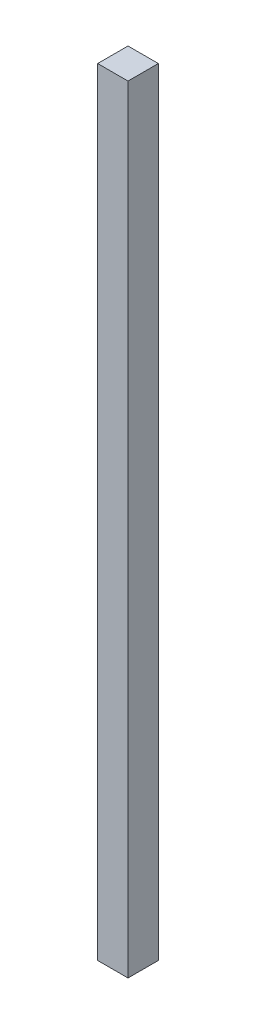
ISO-10303-21;
HEADER;
FILE_DESCRIPTION(('STEP AP214'),'2;1');
FILE_NAME('part.step','',(''),(''),'','','');
FILE_SCHEMA(('AUTOMOTIVE_DESIGN { 1 0 10303 214 1 1 1 1 }'));
ENDSEC;
DATA;
#1=APPLICATION_CONTEXT('core data for automotive mechanical design processes');
#2=APPLICATION_PROTOCOL_DEFINITION('international standard','automotive_design',2000,#1);
#3=PRODUCT_CONTEXT('',#1,'mechanical');
#4=PRODUCT('Part','Part','',(#3));
#5=PRODUCT_RELATED_PRODUCT_CATEGORY('part','',(#4));
#6=PRODUCT_DEFINITION_FORMATION('','',#4);
#7=PRODUCT_DEFINITION_CONTEXT('part definition',#1,'design');
#8=PRODUCT_DEFINITION('design','',#6,#7);
#9=PRODUCT_DEFINITION_SHAPE('','',#8);
#10=(LENGTH_UNIT() NAMED_UNIT(*) SI_UNIT(.MILLI.,.METRE.));
#11=(NAMED_UNIT(*) PLANE_ANGLE_UNIT() SI_UNIT($,.RADIAN.));
#12=(NAMED_UNIT(*) SI_UNIT($,.STERADIAN.) SOLID_ANGLE_UNIT());
#13=UNCERTAINTY_MEASURE_WITH_UNIT(LENGTH_MEASURE(1.E-05),#10,'distance_accuracy_value','');
#14=(GEOMETRIC_REPRESENTATION_CONTEXT(3) GLOBAL_UNCERTAINTY_ASSIGNED_CONTEXT((#13)) GLOBAL_UNIT_ASSIGNED_CONTEXT((#10,
#11,#12)) REPRESENTATION_CONTEXT('',''));
#15=CARTESIAN_POINT('',(0.,0.,0.));
#16=DIRECTION('',(0.,0.,1.));
#17=DIRECTION('',(1.,0.,0.));
#18=AXIS2_PLACEMENT_3D('',#15,#16,#17);
#19=CARTESIAN_POINT('',(-5.,256.,5.));
#20=DIRECTION('',(1.,0.,0.));
#21=DIRECTION('',(0.,0.,-1.));
#22=AXIS2_PLACEMENT_3D('',#19,#20,#21);
#23=PLANE('',#22);
#24=DIRECTION('',(0.,0.,1.));
#25=VECTOR('',#24,1.);
#26=CARTESIAN_POINT('',(-5.,0.,5.));
#27=LINE('',#26,#25);
#28=CARTESIAN_POINT('',(-5.,0.,-5.));
#29=VERTEX_POINT('',#28);
#30=CARTESIAN_POINT('',(-5.,0.,5.));
#31=VERTEX_POINT('',#30);
#32=EDGE_CURVE('E98',#29,#31,#27,.T.);
#33=ORIENTED_EDGE('',*,*,#32,.T.);
#34=DIRECTION('',(0.,-1.,0.));
#35=VECTOR('',#34,1.);
#36=CARTESIAN_POINT('',(-5.,256.,5.));
#37=LINE('',#36,#35);
#38=CARTESIAN_POINT('',(-5.,256.,5.));
#39=VERTEX_POINT('',#38);
#40=EDGE_CURVE('E11',#39,#31,#37,.T.);
#41=ORIENTED_EDGE('',*,*,#40,.F.);
#42=DIRECTION('',(0.,0.,1.));
#43=VECTOR('',#42,1.);
#44=CARTESIAN_POINT('',(-5.,256.,5.));
#45=LINE('',#44,#43);
#46=CARTESIAN_POINT('',(-5.,256.,-5.));
#47=VERTEX_POINT('',#46);
#48=EDGE_CURVE('E86',#47,#39,#45,.T.);
#49=ORIENTED_EDGE('',*,*,#48,.F.);
#50=DIRECTION('',(0.,-1.,0.));
#51=VECTOR('',#50,1.);
#52=CARTESIAN_POINT('',(-5.,256.,-5.));
#53=LINE('',#52,#51);
#54=EDGE_CURVE('E94',#47,#29,#53,.T.);
#55=ORIENTED_EDGE('',*,*,#54,.T.);
#56=EDGE_LOOP('',(#33,#41,#49,#55));
#57=FACE_BOUND('',#56,.T.);
#58=ADVANCED_FACE('F35',(#57),#23,.F.);
#59=CARTESIAN_POINT('',(5.,256.,5.));
#60=DIRECTION('',(0.,0.,-1.));
#61=DIRECTION('',(-1.,0.,0.));
#62=AXIS2_PLACEMENT_3D('',#59,#60,#61);
#63=PLANE('',#62);
#64=DIRECTION('',(1.,0.,0.));
#65=VECTOR('',#64,1.);
#66=CARTESIAN_POINT('',(5.,0.,5.));
#67=LINE('',#66,#65);
#68=CARTESIAN_POINT('',(5.,0.,5.));
#69=VERTEX_POINT('',#68);
#70=EDGE_CURVE('E90',#31,#69,#67,.T.);
#71=ORIENTED_EDGE('',*,*,#70,.T.);
#72=DIRECTION('',(0.,-1.,0.));
#73=VECTOR('',#72,1.);
#74=CARTESIAN_POINT('',(5.,256.,5.));
#75=LINE('',#74,#73);
#76=CARTESIAN_POINT('',(5.,256.,5.));
#77=VERTEX_POINT('',#76);
#78=EDGE_CURVE('E43',#77,#69,#75,.T.);
#79=ORIENTED_EDGE('',*,*,#78,.F.);
#80=DIRECTION('',(1.,0.,0.));
#81=VECTOR('',#80,1.);
#82=CARTESIAN_POINT('',(5.,256.,5.));
#83=LINE('',#82,#81);
#84=EDGE_CURVE('E81',#39,#77,#83,.T.);
#85=ORIENTED_EDGE('',*,*,#84,.F.);
#86=ORIENTED_EDGE('',*,*,#40,.T.);
#87=EDGE_LOOP('',(#71,#79,#85,#86));
#88=FACE_BOUND('',#87,.T.);
#89=ADVANCED_FACE('F89',(#88),#63,.F.);
#90=CARTESIAN_POINT('',(5.,256.,5.));
#91=DIRECTION('',(-1.,0.,0.));
#92=DIRECTION('',(0.,0.,1.));
#93=AXIS2_PLACEMENT_3D('',#90,#91,#92);
#94=PLANE('',#93);
#95=DIRECTION('',(0.,0.,-1.));
#96=VECTOR('',#95,1.);
#97=CARTESIAN_POINT('',(5.,0.,5.));
#98=LINE('',#97,#96);
#99=CARTESIAN_POINT('',(5.,0.,-5.));
#100=VERTEX_POINT('',#99);
#101=EDGE_CURVE('E68',#69,#100,#98,.T.);
#102=ORIENTED_EDGE('',*,*,#101,.T.);
#103=DIRECTION('',(0.,-1.,0.));
#104=VECTOR('',#103,1.);
#105=CARTESIAN_POINT('',(5.,256.,-5.));
#106=LINE('',#105,#104);
#107=CARTESIAN_POINT('',(5.,256.,-5.));
#108=VERTEX_POINT('',#107);
#109=EDGE_CURVE('E91',#108,#100,#106,.T.);
#110=ORIENTED_EDGE('',*,*,#109,.F.);
#111=DIRECTION('',(0.,0.,-1.));
#112=VECTOR('',#111,1.);
#113=CARTESIAN_POINT('',(5.,256.,5.));
#114=LINE('',#113,#112);
#115=EDGE_CURVE('E84',#77,#108,#114,.T.);
#116=ORIENTED_EDGE('',*,*,#115,.F.);
#117=ORIENTED_EDGE('',*,*,#78,.T.);
#118=EDGE_LOOP('',(#102,#110,#116,#117));
#119=FACE_BOUND('',#118,.T.);
#120=ADVANCED_FACE('F92',(#119),#94,.F.);
#121=CARTESIAN_POINT('',(5.,256.,-5.));
#122=DIRECTION('',(0.,0.,1.));
#123=DIRECTION('',(1.,0.,0.));
#124=AXIS2_PLACEMENT_3D('',#121,#122,#123);
#125=PLANE('',#124);
#126=DIRECTION('',(-1.,0.,0.));
#127=VECTOR('',#126,1.);
#128=CARTESIAN_POINT('',(5.,0.,-5.));
#129=LINE('',#128,#127);
#130=EDGE_CURVE('E74',#100,#29,#129,.T.);
#131=ORIENTED_EDGE('',*,*,#130,.T.);
#132=ORIENTED_EDGE('',*,*,#54,.F.);
#133=DIRECTION('',(-1.,0.,0.));
#134=VECTOR('',#133,1.);
#135=CARTESIAN_POINT('',(5.,256.,-5.));
#136=LINE('',#135,#134);
#137=EDGE_CURVE('E51',#108,#47,#136,.T.);
#138=ORIENTED_EDGE('',*,*,#137,.F.);
#139=ORIENTED_EDGE('',*,*,#109,.T.);
#140=EDGE_LOOP('',(#131,#132,#138,#139));
#141=FACE_BOUND('',#140,.T.);
#142=ADVANCED_FACE('F105',(#141),#125,.F.);
#143=CARTESIAN_POINT('',(0.,256.,0.));
#144=DIRECTION('',(0.,1.,0.));
#145=DIRECTION('',(0.,0.,1.));
#146=AXIS2_PLACEMENT_3D('',#143,#144,#145);
#147=PLANE('',#146);
#148=ORIENTED_EDGE('',*,*,#48,.T.);
#149=ORIENTED_EDGE('',*,*,#84,.T.);
#150=ORIENTED_EDGE('',*,*,#115,.T.);
#151=ORIENTED_EDGE('',*,*,#137,.T.);
#152=EDGE_LOOP('',(#148,#149,#150,#151));
#153=FACE_BOUND('',#152,.T.);
#154=ADVANCED_FACE('F82',(#153),#147,.T.);
#155=CARTESIAN_POINT('',(0.,0.,0.));
#156=DIRECTION('',(0.,1.,0.));
#157=DIRECTION('',(0.,0.,1.));
#158=AXIS2_PLACEMENT_3D('',#155,#156,#157);
#159=PLANE('',#158);
#160=ORIENTED_EDGE('',*,*,#32,.F.);
#161=ORIENTED_EDGE('',*,*,#130,.F.);
#162=ORIENTED_EDGE('',*,*,#101,.F.);
#163=ORIENTED_EDGE('',*,*,#70,.F.);
#164=EDGE_LOOP('',(#160,#161,#162,#163));
#165=FACE_BOUND('',#164,.T.);
#166=ADVANCED_FACE('F108',(#165),#159,.F.);
#167=CLOSED_SHELL('',(#58,#89,#120,#142,#154,#166));
#168=MANIFOLD_SOLID_BREP('B2',#167);
#169=ADVANCED_BREP_SHAPE_REPRESENTATION('',(#18,#168),#14);
#170=SHAPE_DEFINITION_REPRESENTATION(#9,#169);
ENDSEC;
END-ISO-10303-21;
